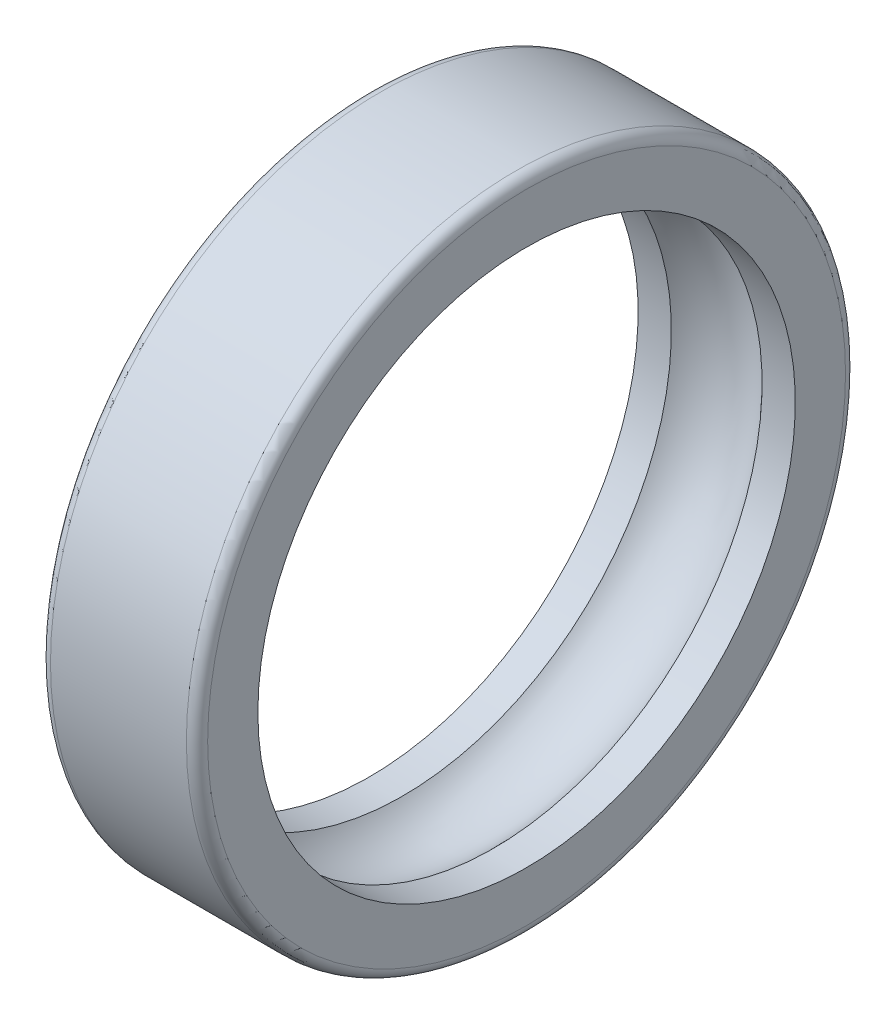
ISO-10303-21;
HEADER;
FILE_DESCRIPTION(('STEP AP214'),'2;1');
FILE_NAME('part.step','',(''),(''),'','','');
FILE_SCHEMA(('AUTOMOTIVE_DESIGN { 1 0 10303 214 1 1 1 1 }'));
ENDSEC;
DATA;
#1=APPLICATION_CONTEXT('core data for automotive mechanical design processes');
#2=APPLICATION_PROTOCOL_DEFINITION('international standard','automotive_design',2000,#1);
#3=PRODUCT_CONTEXT('',#1,'mechanical');
#4=PRODUCT('Part','Part','',(#3));
#5=PRODUCT_RELATED_PRODUCT_CATEGORY('part','',(#4));
#6=PRODUCT_DEFINITION_FORMATION('','',#4);
#7=PRODUCT_DEFINITION_CONTEXT('part definition',#1,'design');
#8=PRODUCT_DEFINITION('design','',#6,#7);
#9=PRODUCT_DEFINITION_SHAPE('','',#8);
#10=(LENGTH_UNIT() NAMED_UNIT(*) SI_UNIT(.MILLI.,.METRE.));
#11=(NAMED_UNIT(*) PLANE_ANGLE_UNIT() SI_UNIT($,.RADIAN.));
#12=(NAMED_UNIT(*) SI_UNIT($,.STERADIAN.) SOLID_ANGLE_UNIT());
#13=UNCERTAINTY_MEASURE_WITH_UNIT(LENGTH_MEASURE(1.E-05),#10,'distance_accuracy_value','');
#14=(GEOMETRIC_REPRESENTATION_CONTEXT(3) GLOBAL_UNCERTAINTY_ASSIGNED_CONTEXT((#13)) GLOBAL_UNIT_ASSIGNED_CONTEXT((#10,
#11,#12)) REPRESENTATION_CONTEXT('',''));
#15=CARTESIAN_POINT('',(0.,0.,0.));
#16=DIRECTION('',(0.,0.,1.));
#17=DIRECTION('',(1.,0.,0.));
#18=AXIS2_PLACEMENT_3D('',#15,#16,#17);
#19=CARTESIAN_POINT('',(-20.2526196060867,0.,0.));
#20=DIRECTION('',(-1.,0.,0.));
#21=DIRECTION('',(0.,0.,1.));
#22=AXIS2_PLACEMENT_3D('',#19,#20,#21);
#23=CYLINDRICAL_SURFACE('',#22,65.);
#24=CARTESIAN_POINT('',(-13.4,0.,0.));
#25=DIRECTION('',(1.,0.,0.));
#26=DIRECTION('',(0.,0.,-1.));
#27=AXIS2_PLACEMENT_3D('',#24,#25,#26);
#28=CIRCLE('',#27,65.);
#29=CARTESIAN_POINT('',(-13.4,0.,-65.));
#30=VERTEX_POINT('',#29);
#31=EDGE_CURVE('E45',#30,#30,#28,.T.);
#32=ORIENTED_EDGE('',*,*,#31,.T.);
#33=EDGE_LOOP('',(#32));
#34=FACE_BOUND('',#33,.T.);
#35=CARTESIAN_POINT('',(13.4,0.,0.));
#36=DIRECTION('',(1.,0.,0.));
#37=DIRECTION('',(0.,0.,-1.));
#38=AXIS2_PLACEMENT_3D('',#35,#36,#37);
#39=CIRCLE('',#38,65.);
#40=CARTESIAN_POINT('',(13.4,0.,-65.));
#41=VERTEX_POINT('',#40);
#42=EDGE_CURVE('E50',#41,#41,#39,.F.);
#43=ORIENTED_EDGE('',*,*,#42,.T.);
#44=EDGE_LOOP('',(#43));
#45=FACE_BOUND('',#44,.T.);
#46=ADVANCED_FACE('F37',(#34,#45),#23,.T.);
#47=CARTESIAN_POINT('',(15.5,65.,0.));
#48=DIRECTION('',(1.,0.,0.));
#49=DIRECTION('',(0.,0.,-1.));
#50=AXIS2_PLACEMENT_3D('',#47,#48,#49);
#51=PLANE('',#50);
#52=CARTESIAN_POINT('',(15.5,0.,0.));
#53=DIRECTION('',(1.,0.,0.));
#54=DIRECTION('',(0.,0.,-1.));
#55=AXIS2_PLACEMENT_3D('',#52,#53,#54);
#56=CIRCLE('',#55,62.9);
#57=CARTESIAN_POINT('',(15.5,0.,-62.9));
#58=VERTEX_POINT('',#57);
#59=EDGE_CURVE('E10',#58,#58,#56,.T.);
#60=ORIENTED_EDGE('',*,*,#59,.T.);
#61=EDGE_LOOP('',(#60));
#62=FACE_BOUND('',#61,.T.);
#63=CARTESIAN_POINT('',(15.5,0.,0.));
#64=DIRECTION('',(-1.,0.,0.));
#65=DIRECTION('',(0.,0.,1.));
#66=AXIS2_PLACEMENT_3D('',#63,#64,#65);
#67=CIRCLE('',#66,53.);
#68=CARTESIAN_POINT('',(15.5,0.,53.));
#69=VERTEX_POINT('',#68);
#70=EDGE_CURVE('E61',#69,#69,#67,.T.);
#71=ORIENTED_EDGE('',*,*,#70,.T.);
#72=EDGE_LOOP('',(#71));
#73=FACE_BOUND('',#72,.T.);
#74=ADVANCED_FACE('F94',(#62,#73),#51,.T.);
#75=CARTESIAN_POINT('',(-20.2526196060867,0.,0.));
#76=DIRECTION('',(-1.,0.,0.));
#77=DIRECTION('',(0.,0.,1.));
#78=AXIS2_PLACEMENT_3D('',#75,#76,#77);
#79=CYLINDRICAL_SURFACE('',#78,53.);
#80=ORIENTED_EDGE('',*,*,#70,.F.);
#81=EDGE_LOOP('',(#80));
#82=FACE_BOUND('',#81,.T.);
#83=CARTESIAN_POINT('',(8.94427190999915,0.,0.));
#84=DIRECTION('',(-1.,0.,0.));
#85=DIRECTION('',(0.,0.,1.));
#86=AXIS2_PLACEMENT_3D('',#83,#84,#85);
#87=CIRCLE('',#86,53.);
#88=CARTESIAN_POINT('',(8.94427190999915,0.,53.));
#89=VERTEX_POINT('',#88);
#90=EDGE_CURVE('E65',#89,#89,#87,.T.);
#91=ORIENTED_EDGE('',*,*,#90,.T.);
#92=EDGE_LOOP('',(#91));
#93=FACE_BOUND('',#92,.T.);
#94=ADVANCED_FACE('F99',(#82,#93),#79,.F.);
#95=CARTESIAN_POINT('',(0.,0.,0.));
#96=DIRECTION('',(-1.,0.,0.));
#97=DIRECTION('',(0.,0.,1.));
#98=AXIS2_PLACEMENT_3D('',#95,#96,#97);
#99=TOROIDAL_SURFACE('',#98,45.,12.);
#100=ORIENTED_EDGE('',*,*,#90,.F.);
#101=EDGE_LOOP('',(#100));
#102=FACE_BOUND('',#101,.T.);
#103=CARTESIAN_POINT('',(-8.94427190999915,0.,0.));
#104=DIRECTION('',(-1.,0.,0.));
#105=DIRECTION('',(0.,0.,1.));
#106=AXIS2_PLACEMENT_3D('',#103,#104,#105);
#107=CIRCLE('',#106,53.);
#108=CARTESIAN_POINT('',(-8.94427190999915,0.,53.));
#109=VERTEX_POINT('',#108);
#110=EDGE_CURVE('E69',#109,#109,#107,.T.);
#111=ORIENTED_EDGE('',*,*,#110,.T.);
#112=EDGE_LOOP('',(#111));
#113=FACE_BOUND('',#112,.T.);
#114=ADVANCED_FACE('F90',(#102,#113),#99,.F.);
#115=CARTESIAN_POINT('',(-20.2526196060867,0.,0.));
#116=DIRECTION('',(-1.,0.,0.));
#117=DIRECTION('',(0.,0.,1.));
#118=AXIS2_PLACEMENT_3D('',#115,#116,#117);
#119=CYLINDRICAL_SURFACE('',#118,53.);
#120=ORIENTED_EDGE('',*,*,#110,.F.);
#121=EDGE_LOOP('',(#120));
#122=FACE_BOUND('',#121,.T.);
#123=CARTESIAN_POINT('',(-15.5,0.,0.));
#124=DIRECTION('',(-1.,0.,0.));
#125=DIRECTION('',(0.,0.,1.));
#126=AXIS2_PLACEMENT_3D('',#123,#124,#125);
#127=CIRCLE('',#126,53.);
#128=CARTESIAN_POINT('',(-15.5,0.,53.));
#129=VERTEX_POINT('',#128);
#130=EDGE_CURVE('E73',#129,#129,#127,.T.);
#131=ORIENTED_EDGE('',*,*,#130,.T.);
#132=EDGE_LOOP('',(#131));
#133=FACE_BOUND('',#132,.T.);
#134=ADVANCED_FACE('F78',(#122,#133),#119,.F.);
#135=CARTESIAN_POINT('',(-15.5,65.,0.));
#136=DIRECTION('',(1.,0.,0.));
#137=DIRECTION('',(0.,0.,-1.));
#138=AXIS2_PLACEMENT_3D('',#135,#136,#137);
#139=PLANE('',#138);
#140=CARTESIAN_POINT('',(-15.5,0.,0.));
#141=DIRECTION('',(1.,0.,0.));
#142=DIRECTION('',(0.,0.,-1.));
#143=AXIS2_PLACEMENT_3D('',#140,#141,#142);
#144=CIRCLE('',#143,62.9);
#145=CARTESIAN_POINT('',(-15.5,0.,-62.9));
#146=VERTEX_POINT('',#145);
#147=EDGE_CURVE('E55',#146,#146,#144,.F.);
#148=ORIENTED_EDGE('',*,*,#147,.T.);
#149=EDGE_LOOP('',(#148));
#150=FACE_BOUND('',#149,.T.);
#151=ORIENTED_EDGE('',*,*,#130,.F.);
#152=EDGE_LOOP('',(#151));
#153=FACE_BOUND('',#152,.T.);
#154=ADVANCED_FACE('F80',(#150,#153),#139,.F.);
#155=CARTESIAN_POINT('',(-13.4,0.,0.));
#156=DIRECTION('',(1.,0.,0.));
#157=DIRECTION('',(0.,0.,-1.));
#158=AXIS2_PLACEMENT_3D('',#155,#156,#157);
#159=TOROIDAL_SURFACE('',#158,62.9,2.1);
#160=ORIENTED_EDGE('',*,*,#31,.F.);
#161=EDGE_LOOP('',(#160));
#162=FACE_BOUND('',#161,.T.);
#163=ORIENTED_EDGE('',*,*,#147,.F.);
#164=EDGE_LOOP('',(#163));
#165=FACE_BOUND('',#164,.T.);
#166=ADVANCED_FACE('F82',(#162,#165),#159,.T.);
#167=CARTESIAN_POINT('',(13.4,0.,0.));
#168=DIRECTION('',(1.,0.,0.));
#169=DIRECTION('',(0.,0.,-1.));
#170=AXIS2_PLACEMENT_3D('',#167,#168,#169);
#171=TOROIDAL_SURFACE('',#170,62.9,2.1);
#172=ORIENTED_EDGE('',*,*,#59,.F.);
#173=EDGE_LOOP('',(#172));
#174=FACE_BOUND('',#173,.T.);
#175=ORIENTED_EDGE('',*,*,#42,.F.);
#176=EDGE_LOOP('',(#175));
#177=FACE_BOUND('',#176,.T.);
#178=ADVANCED_FACE('F39',(#174,#177),#171,.T.);
#179=CLOSED_SHELL('',(#46,#74,#94,#114,#134,#154,#166,#178));
#180=MANIFOLD_SOLID_BREP('B2',#179);
#181=ADVANCED_BREP_SHAPE_REPRESENTATION('',(#18,#180),#14);
#182=SHAPE_DEFINITION_REPRESENTATION(#9,#181);
ENDSEC;
END-ISO-10303-21;
